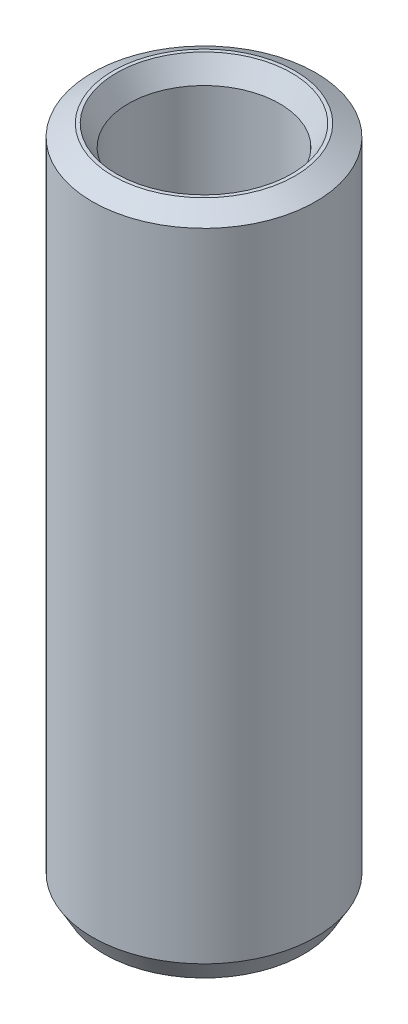
ISO-10303-21;
HEADER;
FILE_DESCRIPTION(('STEP AP214'),'2;1');
FILE_NAME('part.step','',(''),(''),'','','');
FILE_SCHEMA(('AUTOMOTIVE_DESIGN { 1 0 10303 214 1 1 1 1 }'));
ENDSEC;
DATA;
#1=APPLICATION_CONTEXT('core data for automotive mechanical design processes');
#2=APPLICATION_PROTOCOL_DEFINITION('international standard','automotive_design',2000,#1);
#3=PRODUCT_CONTEXT('',#1,'mechanical');
#4=PRODUCT('Part','Part','',(#3));
#5=PRODUCT_RELATED_PRODUCT_CATEGORY('part','',(#4));
#6=PRODUCT_DEFINITION_FORMATION('','',#4);
#7=PRODUCT_DEFINITION_CONTEXT('part definition',#1,'design');
#8=PRODUCT_DEFINITION('design','',#6,#7);
#9=PRODUCT_DEFINITION_SHAPE('','',#8);
#10=(LENGTH_UNIT() NAMED_UNIT(*) SI_UNIT(.MILLI.,.METRE.));
#11=(NAMED_UNIT(*) PLANE_ANGLE_UNIT() SI_UNIT($,.RADIAN.));
#12=(NAMED_UNIT(*) SI_UNIT($,.STERADIAN.) SOLID_ANGLE_UNIT());
#13=UNCERTAINTY_MEASURE_WITH_UNIT(LENGTH_MEASURE(1.E-05),#10,'distance_accuracy_value','');
#14=(GEOMETRIC_REPRESENTATION_CONTEXT(3) GLOBAL_UNCERTAINTY_ASSIGNED_CONTEXT((#13)) GLOBAL_UNIT_ASSIGNED_CONTEXT((#10,
#11,#12)) REPRESENTATION_CONTEXT('',''));
#15=CARTESIAN_POINT('',(0.,0.,0.));
#16=DIRECTION('',(0.,0.,1.));
#17=DIRECTION('',(1.,0.,0.));
#18=AXIS2_PLACEMENT_3D('',#15,#16,#17);
#19=CARTESIAN_POINT('',(0.,209.82009868087,0.));
#20=DIRECTION('',(0.,-1.,0.));
#21=DIRECTION('',(0.,0.,-1.));
#22=AXIS2_PLACEMENT_3D('',#19,#20,#21);
#23=CYLINDRICAL_SURFACE('',#22,35.);
#24=CARTESIAN_POINT('',(0.,6.46889280079593,0.));
#25=DIRECTION('',(0.,1.,0.));
#26=DIRECTION('',(0.,0.,1.));
#27=AXIS2_PLACEMENT_3D('',#24,#25,#26);
#28=CIRCLE('',#27,35.);
#29=CARTESIAN_POINT('',(0.,6.46889280079593,35.));
#30=VERTEX_POINT('',#29);
#31=EDGE_CURVE('E10',#30,#30,#28,.T.);
#32=ORIENTED_EDGE('',*,*,#31,.T.);
#33=EDGE_LOOP('',(#32));
#34=FACE_BOUND('',#33,.T.);
#35=CARTESIAN_POINT('',(0.,206.085281680972,0.));
#36=DIRECTION('',(0.,1.,0.));
#37=DIRECTION('',(0.,0.,1.));
#38=AXIS2_PLACEMENT_3D('',#35,#36,#37);
#39=CIRCLE('',#38,35.);
#40=CARTESIAN_POINT('',(0.,206.085281680972,35.));
#41=VERTEX_POINT('',#40);
#42=EDGE_CURVE('E50',#41,#41,#39,.F.);
#43=ORIENTED_EDGE('',*,*,#42,.T.);
#44=EDGE_LOOP('',(#43));
#45=FACE_BOUND('',#44,.T.);
#46=ADVANCED_FACE('F39',(#34,#45),#23,.T.);
#47=CARTESIAN_POINT('',(0.,209.82009868087,0.));
#48=DIRECTION('',(0.,1.,0.));
#49=DIRECTION('',(0.,0.,1.));
#50=AXIS2_PLACEMENT_3D('',#47,#48,#49);
#51=PLANE('',#50);
#52=CARTESIAN_POINT('',(0.,209.82009868087,0.));
#53=DIRECTION('',(0.,1.,0.));
#54=DIRECTION('',(0.,0.,1.));
#55=AXIS2_PLACEMENT_3D('',#52,#53,#54);
#56=CIRCLE('',#55,27.4363343178667);
#57=CARTESIAN_POINT('',(0.,209.82009868087,27.4363343178667));
#58=VERTEX_POINT('',#57);
#59=EDGE_CURVE('E58',#58,#58,#56,.F.);
#60=ORIENTED_EDGE('',*,*,#59,.T.);
#61=EDGE_LOOP('',(#60));
#62=FACE_BOUND('',#61,.T.);
#63=CARTESIAN_POINT('',(0.,209.82009868087,0.));
#64=DIRECTION('',(0.,1.,0.));
#65=DIRECTION('',(0.,0.,1.));
#66=AXIS2_PLACEMENT_3D('',#63,#64,#65);
#67=CIRCLE('',#66,28.531107199204);
#68=CARTESIAN_POINT('',(0.,209.82009868087,28.531107199204));
#69=VERTEX_POINT('',#68);
#70=EDGE_CURVE('E61',#69,#69,#67,.T.);
#71=ORIENTED_EDGE('',*,*,#70,.T.);
#72=EDGE_LOOP('',(#71));
#73=FACE_BOUND('',#72,.T.);
#74=ADVANCED_FACE('F88',(#62,#73),#51,.T.);
#75=CARTESIAN_POINT('',(0.,0.,0.));
#76=DIRECTION('',(0.,1.,0.));
#77=DIRECTION('',(0.,0.,1.));
#78=AXIS2_PLACEMENT_3D('',#75,#76,#77);
#79=PLANE('',#78);
#80=CARTESIAN_POINT('',(0.,0.,0.));
#81=DIRECTION('',(0.,1.,0.));
#82=DIRECTION('',(0.,0.,1.));
#83=AXIS2_PLACEMENT_3D('',#80,#81,#82);
#84=CIRCLE('',#83,30.1704101187643);
#85=CARTESIAN_POINT('',(0.,0.,30.1704101187643));
#86=VERTEX_POINT('',#85);
#87=EDGE_CURVE('E51',#86,#86,#84,.T.);
#88=ORIENTED_EDGE('',*,*,#87,.T.);
#89=EDGE_LOOP('',(#88));
#90=FACE_BOUND('',#89,.T.);
#91=CARTESIAN_POINT('',(0.,0.,0.));
#92=DIRECTION('',(0.,1.,0.));
#93=DIRECTION('',(0.,0.,1.));
#94=AXIS2_PLACEMENT_3D('',#91,#92,#93);
#95=CIRCLE('',#94,31.2651830001016);
#96=CARTESIAN_POINT('',(0.,0.,31.2651830001016));
#97=VERTEX_POINT('',#96);
#98=EDGE_CURVE('E54',#97,#97,#95,.F.);
#99=ORIENTED_EDGE('',*,*,#98,.T.);
#100=EDGE_LOOP('',(#99));
#101=FACE_BOUND('',#100,.T.);
#102=ADVANCED_FACE('F83',(#90,#101),#79,.F.);
#103=CARTESIAN_POINT('',(0.,209.82009868087,0.));
#104=DIRECTION('',(0.,-1.,0.));
#105=DIRECTION('',(0.,0.,-1.));
#106=AXIS2_PLACEMENT_3D('',#103,#104,#105);
#107=CYLINDRICAL_SURFACE('',#106,23.7015173179683);
#108=CARTESIAN_POINT('',(0.,203.351205880074,0.));
#109=DIRECTION('',(0.,1.,0.));
#110=DIRECTION('',(0.,0.,1.));
#111=AXIS2_PLACEMENT_3D('',#108,#109,#110);
#112=CIRCLE('',#111,23.7015173179683);
#113=CARTESIAN_POINT('',(0.,203.351205880074,23.7015173179683));
#114=VERTEX_POINT('',#113);
#115=EDGE_CURVE('E67',#114,#114,#112,.T.);
#116=ORIENTED_EDGE('',*,*,#115,.T.);
#117=EDGE_LOOP('',(#116));
#118=FACE_BOUND('',#117,.T.);
#119=CARTESIAN_POINT('',(0.,3.73481699989847,0.));
#120=DIRECTION('',(0.,1.,0.));
#121=DIRECTION('',(0.,0.,1.));
#122=AXIS2_PLACEMENT_3D('',#119,#120,#121);
#123=CIRCLE('',#122,23.7015173179683);
#124=CARTESIAN_POINT('',(0.,3.73481699989847,23.7015173179683));
#125=VERTEX_POINT('',#124);
#126=EDGE_CURVE('E69',#125,#125,#123,.F.);
#127=ORIENTED_EDGE('',*,*,#126,.T.);
#128=EDGE_LOOP('',(#127));
#129=FACE_BOUND('',#128,.T.);
#130=ADVANCED_FACE('F71',(#118,#129),#107,.F.);
#131=CARTESIAN_POINT('',(0.,203.351205880074,0.));
#132=DIRECTION('',(0.,1.,0.));
#133=DIRECTION('',(0.,0.,1.));
#134=AXIS2_PLACEMENT_3D('',#131,#132,#133);
#135=CONICAL_SURFACE('',#134,23.7015173179683,0.523598775598298);
#136=ORIENTED_EDGE('',*,*,#59,.F.);
#137=EDGE_LOOP('',(#136));
#138=FACE_BOUND('',#137,.T.);
#139=ORIENTED_EDGE('',*,*,#115,.F.);
#140=EDGE_LOOP('',(#139));
#141=FACE_BOUND('',#140,.T.);
#142=ADVANCED_FACE('F77',(#138,#141),#135,.F.);
#143=CARTESIAN_POINT('',(0.,0.,0.));
#144=DIRECTION('',(0.,-1.,0.));
#145=DIRECTION('',(0.,0.,-1.));
#146=AXIS2_PLACEMENT_3D('',#143,#144,#145);
#147=CONICAL_SURFACE('',#146,30.1704101187643,1.04719755119659);
#148=ORIENTED_EDGE('',*,*,#126,.F.);
#149=EDGE_LOOP('',(#148));
#150=FACE_BOUND('',#149,.T.);
#151=ORIENTED_EDGE('',*,*,#87,.F.);
#152=EDGE_LOOP('',(#151));
#153=FACE_BOUND('',#152,.T.);
#154=ADVANCED_FACE('F73',(#150,#153),#147,.F.);
#155=CARTESIAN_POINT('',(0.,6.46889280079593,0.));
#156=DIRECTION('',(0.,1.,0.));
#157=DIRECTION('',(0.,0.,1.));
#158=AXIS2_PLACEMENT_3D('',#155,#156,#157);
#159=CONICAL_SURFACE('',#158,35.,0.523598775598302);
#160=ORIENTED_EDGE('',*,*,#98,.F.);
#161=EDGE_LOOP('',(#160));
#162=FACE_BOUND('',#161,.T.);
#163=ORIENTED_EDGE('',*,*,#31,.F.);
#164=EDGE_LOOP('',(#163));
#165=FACE_BOUND('',#164,.T.);
#166=ADVANCED_FACE('F76',(#162,#165),#159,.T.);
#167=CARTESIAN_POINT('',(0.,209.82009868087,0.));
#168=DIRECTION('',(0.,-1.,0.));
#169=DIRECTION('',(0.,0.,-1.));
#170=AXIS2_PLACEMENT_3D('',#167,#168,#169);
#171=CONICAL_SURFACE('',#170,28.531107199204,1.04719755119659);
#172=ORIENTED_EDGE('',*,*,#42,.F.);
#173=EDGE_LOOP('',(#172));
#174=FACE_BOUND('',#173,.T.);
#175=ORIENTED_EDGE('',*,*,#70,.F.);
#176=EDGE_LOOP('',(#175));
#177=FACE_BOUND('',#176,.T.);
#178=ADVANCED_FACE('F45',(#174,#177),#171,.T.);
#179=CLOSED_SHELL('',(#46,#74,#102,#130,#142,#154,#166,#178));
#180=MANIFOLD_SOLID_BREP('B2',#179);
#181=ADVANCED_BREP_SHAPE_REPRESENTATION('',(#18,#180),#14);
#182=SHAPE_DEFINITION_REPRESENTATION(#9,#181);
ENDSEC;
END-ISO-10303-21;
